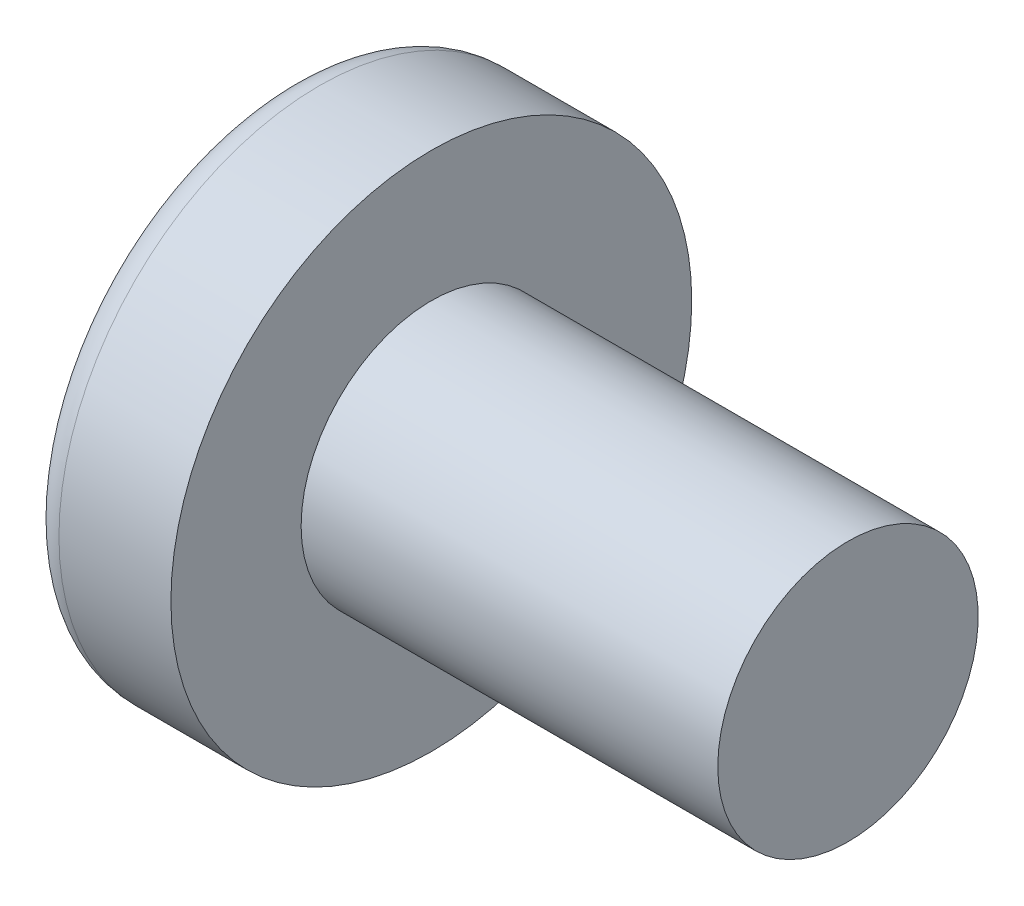
ISO-10303-21;
HEADER;
FILE_DESCRIPTION(('STEP AP214'),'2;1');
FILE_NAME('part.step','',(''),(''),'','','');
FILE_SCHEMA(('AUTOMOTIVE_DESIGN { 1 0 10303 214 1 1 1 1 }'));
ENDSEC;
DATA;
#1=APPLICATION_CONTEXT('core data for automotive mechanical design processes');
#2=APPLICATION_PROTOCOL_DEFINITION('international standard','automotive_design',2000,#1);
#3=PRODUCT_CONTEXT('',#1,'mechanical');
#4=PRODUCT('Part','Part','',(#3));
#5=PRODUCT_RELATED_PRODUCT_CATEGORY('part','',(#4));
#6=PRODUCT_DEFINITION_FORMATION('','',#4);
#7=PRODUCT_DEFINITION_CONTEXT('part definition',#1,'design');
#8=PRODUCT_DEFINITION('design','',#6,#7);
#9=PRODUCT_DEFINITION_SHAPE('','',#8);
#10=(LENGTH_UNIT() NAMED_UNIT(*) SI_UNIT(.MILLI.,.METRE.));
#11=(NAMED_UNIT(*) PLANE_ANGLE_UNIT() SI_UNIT($,.RADIAN.));
#12=(NAMED_UNIT(*) SI_UNIT($,.STERADIAN.) SOLID_ANGLE_UNIT());
#13=UNCERTAINTY_MEASURE_WITH_UNIT(LENGTH_MEASURE(1.E-05),#10,'distance_accuracy_value','');
#14=(GEOMETRIC_REPRESENTATION_CONTEXT(3) GLOBAL_UNCERTAINTY_ASSIGNED_CONTEXT((#13)) GLOBAL_UNIT_ASSIGNED_CONTEXT((#10,
#11,#12)) REPRESENTATION_CONTEXT('',''));
#15=CARTESIAN_POINT('',(0.,0.,0.));
#16=DIRECTION('',(0.,0.,1.));
#17=DIRECTION('',(1.,0.,0.));
#18=AXIS2_PLACEMENT_3D('',#15,#16,#17);
#19=CARTESIAN_POINT('',(4.,0.,0.));
#20=DIRECTION('',(-1.,0.,0.));
#21=DIRECTION('',(0.,1.,0.));
#22=AXIS2_PLACEMENT_3D('',#19,#20,#21);
#23=SPHERICAL_SURFACE('',#22,4.);
#24=CARTESIAN_POINT('',(0.783897344725726,0.,0.));
#25=DIRECTION('',(-1.,0.,0.));
#26=DIRECTION('',(0.,0.,1.));
#27=AXIS2_PLACEMENT_3D('',#24,#25,#26);
#28=CIRCLE('',#27,2.37837837837838);
#29=CARTESIAN_POINT('',(0.783897344725726,0.,2.37837837837838));
#30=VERTEX_POINT('',#29);
#31=EDGE_CURVE('E153',#30,#30,#28,.T.);
#32=ORIENTED_EDGE('',*,*,#31,.T.);
#33=EDGE_LOOP('',(#32));
#34=FACE_BOUND('',#33,.T.);
#35=CARTESIAN_POINT('',(3.98786118636742,-0.106127913473398,0.));
#36=DIRECTION('',(-0.11363816050966,-0.993522203313032,0.));
#37=DIRECTION('',(0.993522203313032,-0.11363816050966,0.));
#38=AXIS2_PLACEMENT_3D('',#35,#36,#37);
#39=CIRCLE('',#38,3.99857343501221);
#40=CARTESIAN_POINT('',(0.195539940029892,0.327634320584812,1.19110847703606));
#41=VERTEX_POINT('',#40);
#42=CARTESIAN_POINT('',(0.0301382525496408,0.346552814250857,0.346552814250858));
#43=VERTEX_POINT('',#42);
#44=EDGE_CURVE('E184',#41,#43,#39,.T.);
#45=ORIENTED_EDGE('',*,*,#44,.F.);
#46=CARTESIAN_POINT('',(3.17784904512422,0.,-1.07973473043772));
#47=DIRECTION('',(0.605808178465614,0.,0.795610740817502));
#48=DIRECTION('',(0.795610740817502,0.,-0.605808178465614));
#49=AXIS2_PLACEMENT_3D('',#46,#47,#48);
#50=CIRCLE('',#49,3.76274377539628);
#51=CARTESIAN_POINT('',(0.195539940029892,-0.327634320584821,1.19110847703606));
#52=VERTEX_POINT('',#51);
#53=EDGE_CURVE('E149',#41,#52,#50,.T.);
#54=ORIENTED_EDGE('',*,*,#53,.T.);
#55=CARTESIAN_POINT('',(3.98786118636742,0.106127913473398,0.));
#56=DIRECTION('',(-0.11363816050966,0.993522203313032,0.));
#57=DIRECTION('',(-0.993522203313032,-0.11363816050966,0.));
#58=AXIS2_PLACEMENT_3D('',#55,#56,#57);
#59=CIRCLE('',#58,3.99857343501221);
#60=CARTESIAN_POINT('',(0.0301382525496408,-0.346552814250859,0.346552814250858));
#61=VERTEX_POINT('',#60);
#62=EDGE_CURVE('E105',#61,#52,#59,.T.);
#63=ORIENTED_EDGE('',*,*,#62,.F.);
#64=CARTESIAN_POINT('',(3.98786118636742,0.,-0.106127913473398));
#65=DIRECTION('',(-0.11363816050966,0.,-0.993522203313032));
#66=DIRECTION('',(-0.993522203313032,0.,0.11363816050966));
#67=AXIS2_PLACEMENT_3D('',#64,#65,#66);
#68=CIRCLE('',#67,3.99857343501221);
#69=CARTESIAN_POINT('',(0.195539940029892,-1.19110847703606,0.327634320584816));
#70=VERTEX_POINT('',#69);
#71=EDGE_CURVE('E130',#70,#61,#68,.T.);
#72=ORIENTED_EDGE('',*,*,#71,.F.);
#73=CARTESIAN_POINT('',(3.17784904512422,1.07973473043772,0.));
#74=DIRECTION('',(0.605808178465614,-0.795610740817502,0.));
#75=DIRECTION('',(0.795610740817502,0.605808178465614,0.));
#76=AXIS2_PLACEMENT_3D('',#73,#74,#75);
#77=CIRCLE('',#76,3.76274377539628);
#78=CARTESIAN_POINT('',(0.195539940029892,-1.19110847703606,-0.327634320584816));
#79=VERTEX_POINT('',#78);
#80=EDGE_CURVE('E138',#70,#79,#77,.T.);
#81=ORIENTED_EDGE('',*,*,#80,.T.);
#82=CARTESIAN_POINT('',(3.98786118636742,0.,0.106127913473398));
#83=DIRECTION('',(-0.11363816050966,0.,0.993522203313032));
#84=DIRECTION('',(0.993522203313032,0.,0.11363816050966));
#85=AXIS2_PLACEMENT_3D('',#82,#83,#84);
#86=CIRCLE('',#85,3.99857343501221);
#87=CARTESIAN_POINT('',(0.0301382525496408,-0.346552814250857,-0.346552814250858));
#88=VERTEX_POINT('',#87);
#89=EDGE_CURVE('E48',#88,#79,#86,.T.);
#90=ORIENTED_EDGE('',*,*,#89,.F.);
#91=CARTESIAN_POINT('',(0.195539940029892,-0.327634320584812,-1.19110847703606));
#92=VERTEX_POINT('',#91);
#93=EDGE_CURVE('E191',#92,#88,#59,.T.);
#94=ORIENTED_EDGE('',*,*,#93,.F.);
#95=CARTESIAN_POINT('',(3.17784904512422,0.,1.07973473043772));
#96=DIRECTION('',(0.605808178465614,0.,-0.795610740817502));
#97=DIRECTION('',(-0.795610740817502,0.,-0.605808178465614));
#98=AXIS2_PLACEMENT_3D('',#95,#96,#97);
#99=CIRCLE('',#98,3.76274377539628);
#100=CARTESIAN_POINT('',(0.195539940029892,0.32763432058482,-1.19110847703606));
#101=VERTEX_POINT('',#100);
#102=EDGE_CURVE('E131',#92,#101,#99,.T.);
#103=ORIENTED_EDGE('',*,*,#102,.T.);
#104=CARTESIAN_POINT('',(0.0301382525496408,0.346552814250859,-0.346552814250858));
#105=VERTEX_POINT('',#104);
#106=EDGE_CURVE('E179',#105,#101,#39,.T.);
#107=ORIENTED_EDGE('',*,*,#106,.F.);
#108=CARTESIAN_POINT('',(0.195539940029892,1.19110847703606,-0.327634320584816));
#109=VERTEX_POINT('',#108);
#110=EDGE_CURVE('E41',#109,#105,#86,.T.);
#111=ORIENTED_EDGE('',*,*,#110,.F.);
#112=CARTESIAN_POINT('',(3.17784904512422,-1.07973473043772,0.));
#113=DIRECTION('',(0.605808178465614,0.795610740817502,0.));
#114=DIRECTION('',(-0.795610740817502,0.605808178465614,0.));
#115=AXIS2_PLACEMENT_3D('',#112,#113,#114);
#116=CIRCLE('',#115,3.76274377539628);
#117=CARTESIAN_POINT('',(0.195539940029892,1.19110847703606,0.327634320584816));
#118=VERTEX_POINT('',#117);
#119=EDGE_CURVE('E11',#109,#118,#116,.T.);
#120=ORIENTED_EDGE('',*,*,#119,.T.);
#121=EDGE_CURVE('E167',#43,#118,#68,.T.);
#122=ORIENTED_EDGE('',*,*,#121,.F.);
#123=EDGE_LOOP('',(#45,#54,#63,#72,#81,#90,#94,#103,#107,#111,#120,#122));
#124=FACE_BOUND('',#123,.T.);
#125=ADVANCED_FACE('F33',(#34,#124),#23,.T.);
#126=CARTESIAN_POINT('',(1.75982832618026,0.,-0.148712446351931));
#127=DIRECTION('',(-0.11363816050966,0.,0.993522203313032));
#128=DIRECTION('',(0.993522203313032,0.,0.11363816050966));
#129=AXIS2_PLACEMENT_3D('',#126,#127,#128);
#130=PLANE('',#129);
#131=ORIENTED_EDGE('',*,*,#110,.T.);
#132=DIRECTION('',(0.987168682960152,-0.112911450665377,0.112911450665377));
#133=VECTOR('',#132,1.);
#134=CARTESIAN_POINT('',(1.77640420924781,0.14681651201414,-0.146816512014139));
#135=LINE('',#134,#133);
#136=CARTESIAN_POINT('',(1.53,0.175000000000001,-0.174999999999999));
#137=VERTEX_POINT('',#136);
#138=EDGE_CURVE('E173',#105,#137,#135,.T.);
#139=ORIENTED_EDGE('',*,*,#138,.T.);
#140=DIRECTION('',(0.792336746135061,-0.603315234802187,0.0906267520089122));
#141=VECTOR('',#140,1.);
#142=CARTESIAN_POINT('',(0.,1.34,-0.35));
#143=LINE('',#142,#141);
#144=EDGE_CURVE('E154',#109,#137,#143,.T.);
#145=ORIENTED_EDGE('',*,*,#144,.F.);
#146=EDGE_LOOP('',(#131,#139,#145));
#147=FACE_BOUND('',#146,.T.);
#148=ADVANCED_FACE('F172',(#147),#130,.T.);
#149=DIRECTION('',(0.792336746135061,0.603315234802187,0.0906267520089123));
#150=VECTOR('',#149,1.);
#151=CARTESIAN_POINT('',(0.,-1.34,-0.35));
#152=LINE('',#151,#150);
#153=CARTESIAN_POINT('',(1.53,-0.175,-0.175));
#154=VERTEX_POINT('',#153);
#155=EDGE_CURVE('E139',#79,#154,#152,.T.);
#156=ORIENTED_EDGE('',*,*,#155,.T.);
#157=DIRECTION('',(-0.987168682960152,-0.112911450665376,-0.112911450665377));
#158=VECTOR('',#157,1.);
#159=CARTESIAN_POINT('',(1.77640420924781,-0.146816512014138,-0.146816512014139));
#160=LINE('',#159,#158);
#161=EDGE_CURVE('E194',#154,#88,#160,.T.);
#162=ORIENTED_EDGE('',*,*,#161,.T.);
#163=ORIENTED_EDGE('',*,*,#89,.T.);
#164=EDGE_LOOP('',(#156,#162,#163));
#165=FACE_BOUND('',#164,.T.);
#166=ADVANCED_FACE('F209',(#165),#130,.T.);
#167=CARTESIAN_POINT('',(1.75982832618026,0.,0.148712446351931));
#168=DIRECTION('',(-0.11363816050966,0.,-0.993522203313032));
#169=DIRECTION('',(-0.993522203313032,0.,0.11363816050966));
#170=AXIS2_PLACEMENT_3D('',#167,#168,#169);
#171=PLANE('',#170);
#172=DIRECTION('',(0.792336746135061,-0.603315234802187,-0.0906267520089123));
#173=VECTOR('',#172,1.);
#174=CARTESIAN_POINT('',(0.,1.34,0.35));
#175=LINE('',#174,#173);
#176=CARTESIAN_POINT('',(1.53,0.175,0.175));
#177=VERTEX_POINT('',#176);
#178=EDGE_CURVE('E210',#118,#177,#175,.T.);
#179=ORIENTED_EDGE('',*,*,#178,.T.);
#180=DIRECTION('',(-0.987168682960152,0.112911450665376,0.112911450665377));
#181=VECTOR('',#180,1.);
#182=CARTESIAN_POINT('',(1.77640420924781,0.146816512014139,0.146816512014139));
#183=LINE('',#182,#181);
#184=EDGE_CURVE('E188',#177,#43,#183,.T.);
#185=ORIENTED_EDGE('',*,*,#184,.T.);
#186=ORIENTED_EDGE('',*,*,#121,.T.);
#187=EDGE_LOOP('',(#179,#185,#186));
#188=FACE_BOUND('',#187,.T.);
#189=ADVANCED_FACE('F214',(#188),#171,.T.);
#190=ORIENTED_EDGE('',*,*,#71,.T.);
#191=DIRECTION('',(0.987168682960152,0.112911450665377,-0.112911450665377));
#192=VECTOR('',#191,1.);
#193=CARTESIAN_POINT('',(1.77640420924781,-0.14681651201414,0.146816512014139));
#194=LINE('',#193,#192);
#195=CARTESIAN_POINT('',(1.53,-0.175000000000001,0.174999999999999));
#196=VERTEX_POINT('',#195);
#197=EDGE_CURVE('E103',#61,#196,#194,.T.);
#198=ORIENTED_EDGE('',*,*,#197,.T.);
#199=DIRECTION('',(0.792336746135061,0.603315234802187,-0.0906267520089121));
#200=VECTOR('',#199,1.);
#201=CARTESIAN_POINT('',(0.,-1.34,0.35));
#202=LINE('',#201,#200);
#203=EDGE_CURVE('E128',#70,#196,#202,.T.);
#204=ORIENTED_EDGE('',*,*,#203,.F.);
#205=EDGE_LOOP('',(#190,#198,#204));
#206=FACE_BOUND('',#205,.T.);
#207=ADVANCED_FACE('F127',(#206),#171,.T.);
#208=CARTESIAN_POINT('',(-25.4,0.,0.));
#209=DIRECTION('',(-1.,0.,0.));
#210=DIRECTION('',(0.,0.,1.));
#211=AXIS2_PLACEMENT_3D('',#208,#209,#210);
#212=CYLINDRICAL_SURFACE('',#211,1.25);
#213=CARTESIAN_POINT('',(6.1,0.,0.));
#214=DIRECTION('',(-1.,0.,0.));
#215=DIRECTION('',(0.,0.,1.));
#216=AXIS2_PLACEMENT_3D('',#213,#214,#215);
#217=CIRCLE('',#216,1.25);
#218=CARTESIAN_POINT('',(6.1,0.,1.25));
#219=VERTEX_POINT('',#218);
#220=EDGE_CURVE('E150',#219,#219,#217,.T.);
#221=ORIENTED_EDGE('',*,*,#220,.T.);
#222=EDGE_LOOP('',(#221));
#223=FACE_BOUND('',#222,.T.);
#224=CARTESIAN_POINT('',(2.1,0.,0.));
#225=DIRECTION('',(-1.,0.,0.));
#226=DIRECTION('',(0.,0.,1.));
#227=AXIS2_PLACEMENT_3D('',#224,#225,#226);
#228=CIRCLE('',#227,1.25);
#229=CARTESIAN_POINT('',(2.1,0.,1.25));
#230=VERTEX_POINT('',#229);
#231=EDGE_CURVE('E163',#230,#230,#228,.T.);
#232=ORIENTED_EDGE('',*,*,#231,.F.);
#233=EDGE_LOOP('',(#232));
#234=FACE_BOUND('',#233,.T.);
#235=ADVANCED_FACE('F35',(#223,#234),#212,.T.);
#236=CARTESIAN_POINT('',(2.1,1.25,0.));
#237=DIRECTION('',(-1.,0.,0.));
#238=DIRECTION('',(0.,0.,1.));
#239=AXIS2_PLACEMENT_3D('',#236,#237,#238);
#240=PLANE('',#239);
#241=CARTESIAN_POINT('',(2.1,0.,0.));
#242=DIRECTION('',(-1.,0.,0.));
#243=DIRECTION('',(0.,0.,1.));
#244=AXIS2_PLACEMENT_3D('',#241,#242,#243);
#245=CIRCLE('',#244,2.5);
#246=CARTESIAN_POINT('',(2.1,0.,2.5));
#247=VERTEX_POINT('',#246);
#248=EDGE_CURVE('E160',#247,#247,#245,.T.);
#249=ORIENTED_EDGE('',*,*,#248,.F.);
#250=EDGE_LOOP('',(#249));
#251=FACE_BOUND('',#250,.T.);
#252=ORIENTED_EDGE('',*,*,#231,.T.);
#253=EDGE_LOOP('',(#252));
#254=FACE_BOUND('',#253,.T.);
#255=ADVANCED_FACE('F242',(#251,#254),#240,.F.);
#256=CARTESIAN_POINT('',(-25.4,0.,0.));
#257=DIRECTION('',(-1.,0.,0.));
#258=DIRECTION('',(0.,0.,1.));
#259=AXIS2_PLACEMENT_3D('',#256,#257,#258);
#260=CYLINDRICAL_SURFACE('',#259,2.5);
#261=ORIENTED_EDGE('',*,*,#248,.T.);
#262=EDGE_LOOP('',(#261));
#263=FACE_BOUND('',#262,.T.);
#264=CARTESIAN_POINT('',(1.0251050438713,0.,0.));
#265=DIRECTION('',(-1.,0.,0.));
#266=DIRECTION('',(0.,0.,1.));
#267=AXIS2_PLACEMENT_3D('',#264,#265,#266);
#268=CIRCLE('',#267,2.5);
#269=CARTESIAN_POINT('',(1.0251050438713,0.,2.5));
#270=VERTEX_POINT('',#269);
#271=EDGE_CURVE('E157',#270,#270,#268,.T.);
#272=ORIENTED_EDGE('',*,*,#271,.F.);
#273=EDGE_LOOP('',(#272));
#274=FACE_BOUND('',#273,.T.);
#275=ADVANCED_FACE('F239',(#263,#274),#260,.T.);
#276=CARTESIAN_POINT('',(1.0251050438713,0.,0.));
#277=DIRECTION('',(-1.,0.,0.));
#278=DIRECTION('',(0.,0.,1.));
#279=AXIS2_PLACEMENT_3D('',#276,#277,#278);
#280=TOROIDAL_SURFACE('',#279,2.2,0.3);
#281=ORIENTED_EDGE('',*,*,#271,.T.);
#282=EDGE_LOOP('',(#281));
#283=FACE_BOUND('',#282,.T.);
#284=ORIENTED_EDGE('',*,*,#31,.F.);
#285=EDGE_LOOP('',(#284));
#286=FACE_BOUND('',#285,.T.);
#287=ADVANCED_FACE('F236',(#283,#286),#280,.T.);
#288=CARTESIAN_POINT('',(6.1,1.25,0.));
#289=DIRECTION('',(1.,0.,0.));
#290=DIRECTION('',(0.,0.,-1.));
#291=AXIS2_PLACEMENT_3D('',#288,#289,#290);
#292=PLANE('',#291);
#293=ORIENTED_EDGE('',*,*,#220,.F.);
#294=EDGE_LOOP('',(#293));
#295=FACE_BOUND('',#294,.T.);
#296=ADVANCED_FACE('F234',(#295),#292,.T.);
#297=CARTESIAN_POINT('',(1.53,0.175,0.175));
#298=DIRECTION('',(0.605808178465614,0.795610740817502,0.));
#299=DIRECTION('',(-0.795610740817502,0.605808178465614,0.));
#300=AXIS2_PLACEMENT_3D('',#297,#298,#299);
#301=PLANE('',#300);
#302=ORIENTED_EDGE('',*,*,#144,.T.);
#303=DIRECTION('',(0.,0.,-1.));
#304=VECTOR('',#303,1.);
#305=CARTESIAN_POINT('',(1.53,0.175,0.175));
#306=LINE('',#305,#304);
#307=EDGE_CURVE('E121',#177,#137,#306,.T.);
#308=ORIENTED_EDGE('',*,*,#307,.F.);
#309=ORIENTED_EDGE('',*,*,#178,.F.);
#310=ORIENTED_EDGE('',*,*,#119,.F.);
#311=EDGE_LOOP('',(#302,#308,#309,#310));
#312=FACE_BOUND('',#311,.T.);
#313=ADVANCED_FACE('F213',(#312),#301,.F.);
#314=CARTESIAN_POINT('',(1.53,-0.175,-0.175));
#315=DIRECTION('',(0.605808178465614,-0.795610740817502,0.));
#316=DIRECTION('',(0.795610740817502,0.605808178465614,0.));
#317=AXIS2_PLACEMENT_3D('',#314,#315,#316);
#318=PLANE('',#317);
#319=ORIENTED_EDGE('',*,*,#203,.T.);
#320=DIRECTION('',(0.,0.,1.));
#321=VECTOR('',#320,1.);
#322=CARTESIAN_POINT('',(1.53,-0.175,-0.175));
#323=LINE('',#322,#321);
#324=EDGE_CURVE('E120',#154,#196,#323,.T.);
#325=ORIENTED_EDGE('',*,*,#324,.F.);
#326=ORIENTED_EDGE('',*,*,#155,.F.);
#327=ORIENTED_EDGE('',*,*,#80,.F.);
#328=EDGE_LOOP('',(#319,#325,#326,#327));
#329=FACE_BOUND('',#328,.T.);
#330=ADVANCED_FACE('F135',(#329),#318,.F.);
#331=CARTESIAN_POINT('',(1.53,-0.175,-0.175));
#332=DIRECTION('',(1.,0.,0.));
#333=DIRECTION('',(0.,0.,-1.));
#334=AXIS2_PLACEMENT_3D('',#331,#332,#333);
#335=PLANE('',#334);
#336=DIRECTION('',(0.,1.,0.));
#337=VECTOR('',#336,1.);
#338=CARTESIAN_POINT('',(1.53,-0.175,-0.175));
#339=LINE('',#338,#337);
#340=EDGE_CURVE('E143',#154,#137,#339,.T.);
#341=ORIENTED_EDGE('',*,*,#340,.F.);
#342=ORIENTED_EDGE('',*,*,#324,.T.);
#343=DIRECTION('',(0.,-1.,0.));
#344=VECTOR('',#343,1.);
#345=CARTESIAN_POINT('',(1.53,0.175,0.175));
#346=LINE('',#345,#344);
#347=EDGE_CURVE('E112',#177,#196,#346,.T.);
#348=ORIENTED_EDGE('',*,*,#347,.F.);
#349=ORIENTED_EDGE('',*,*,#307,.T.);
#350=EDGE_LOOP('',(#341,#342,#348,#349));
#351=FACE_BOUND('',#350,.T.);
#352=ADVANCED_FACE('F141',(#351),#335,.F.);
#353=CARTESIAN_POINT('',(1.53,0.175000000000001,-0.174999999999999));
#354=DIRECTION('',(0.605808178465614,0.,-0.795610740817502));
#355=DIRECTION('',(0.795610740817502,0.,0.605808178465614));
#356=AXIS2_PLACEMENT_3D('',#353,#354,#355);
#357=PLANE('',#356);
#358=DIRECTION('',(0.792336746135061,0.09062675200891,0.603315234802188));
#359=VECTOR('',#358,1.);
#360=CARTESIAN_POINT('',(0.,-0.349999999999995,-1.34));
#361=LINE('',#360,#359);
#362=EDGE_CURVE('E199',#92,#154,#361,.T.);
#363=ORIENTED_EDGE('',*,*,#362,.T.);
#364=ORIENTED_EDGE('',*,*,#340,.T.);
#365=DIRECTION('',(0.792336746135061,-0.0906267520089144,0.603315234802187));
#366=VECTOR('',#365,1.);
#367=CARTESIAN_POINT('',(0.,0.350000000000005,-1.34));
#368=LINE('',#367,#366);
#369=EDGE_CURVE('E109',#101,#137,#368,.T.);
#370=ORIENTED_EDGE('',*,*,#369,.F.);
#371=ORIENTED_EDGE('',*,*,#102,.F.);
#372=EDGE_LOOP('',(#363,#364,#370,#371));
#373=FACE_BOUND('',#372,.T.);
#374=ADVANCED_FACE('F204',(#373),#357,.F.);
#375=CARTESIAN_POINT('',(1.75982832618026,-0.148712446351931,0.));
#376=DIRECTION('',(-0.11363816050966,0.993522203313032,0.));
#377=DIRECTION('',(-0.993522203313032,-0.11363816050966,0.));
#378=AXIS2_PLACEMENT_3D('',#375,#376,#377);
#379=PLANE('',#378);
#380=ORIENTED_EDGE('',*,*,#93,.T.);
#381=ORIENTED_EDGE('',*,*,#161,.F.);
#382=ORIENTED_EDGE('',*,*,#362,.F.);
#383=EDGE_LOOP('',(#380,#381,#382));
#384=FACE_BOUND('',#383,.T.);
#385=ADVANCED_FACE('F208',(#384),#379,.T.);
#386=CARTESIAN_POINT('',(1.75982832618026,0.148712446351931,0.));
#387=DIRECTION('',(-0.11363816050966,-0.993522203313032,0.));
#388=DIRECTION('',(0.993522203313032,-0.11363816050966,0.));
#389=AXIS2_PLACEMENT_3D('',#386,#387,#388);
#390=PLANE('',#389);
#391=ORIENTED_EDGE('',*,*,#106,.T.);
#392=ORIENTED_EDGE('',*,*,#369,.T.);
#393=ORIENTED_EDGE('',*,*,#138,.F.);
#394=EDGE_LOOP('',(#391,#392,#393));
#395=FACE_BOUND('',#394,.T.);
#396=ADVANCED_FACE('F202',(#395),#390,.T.);
#397=CARTESIAN_POINT('',(1.53,-0.175000000000001,0.174999999999999));
#398=DIRECTION('',(0.605808178465614,0.,0.795610740817502));
#399=DIRECTION('',(-0.795610740817502,0.,0.605808178465614));
#400=AXIS2_PLACEMENT_3D('',#397,#398,#399);
#401=PLANE('',#400);
#402=DIRECTION('',(0.792336746135061,-0.0906267520089101,-0.603315234802188));
#403=VECTOR('',#402,1.);
#404=CARTESIAN_POINT('',(0.,0.349999999999995,1.34));
#405=LINE('',#404,#403);
#406=EDGE_CURVE('E108',#41,#177,#405,.T.);
#407=ORIENTED_EDGE('',*,*,#406,.T.);
#408=ORIENTED_EDGE('',*,*,#347,.T.);
#409=DIRECTION('',(0.792336746135061,0.0906267520089144,-0.603315234802187));
#410=VECTOR('',#409,1.);
#411=CARTESIAN_POINT('',(0.,-0.350000000000005,1.34));
#412=LINE('',#411,#410);
#413=EDGE_CURVE('E99',#52,#196,#412,.T.);
#414=ORIENTED_EDGE('',*,*,#413,.F.);
#415=ORIENTED_EDGE('',*,*,#53,.F.);
#416=EDGE_LOOP('',(#407,#408,#414,#415));
#417=FACE_BOUND('',#416,.T.);
#418=ADVANCED_FACE('F113',(#417),#401,.F.);
#419=ORIENTED_EDGE('',*,*,#44,.T.);
#420=ORIENTED_EDGE('',*,*,#184,.F.);
#421=ORIENTED_EDGE('',*,*,#406,.F.);
#422=EDGE_LOOP('',(#419,#420,#421));
#423=FACE_BOUND('',#422,.T.);
#424=ADVANCED_FACE('F215',(#423),#390,.T.);
#425=ORIENTED_EDGE('',*,*,#62,.T.);
#426=ORIENTED_EDGE('',*,*,#413,.T.);
#427=ORIENTED_EDGE('',*,*,#197,.F.);
#428=EDGE_LOOP('',(#425,#426,#427));
#429=FACE_BOUND('',#428,.T.);
#430=ADVANCED_FACE('F101',(#429),#379,.T.);
#431=CLOSED_SHELL('',(#125,#148,#166,#189,#207,#235,#255,#275,#287,#296,#313,#330,#352,#374,
#385,#396,#418,#424,#430));
#432=MANIFOLD_SOLID_BREP('B2',#431);
#433=ADVANCED_BREP_SHAPE_REPRESENTATION('',(#18,#432),#14);
#434=SHAPE_DEFINITION_REPRESENTATION(#9,#433);
ENDSEC;
END-ISO-10303-21;
